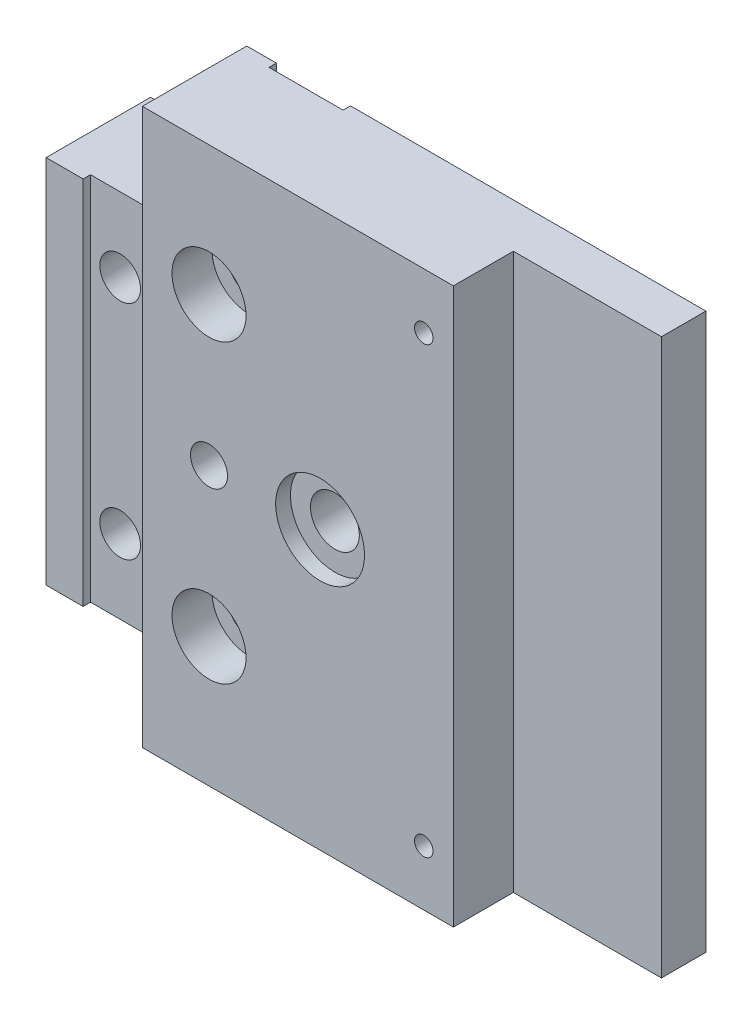
ISO-10303-21;
HEADER;
FILE_DESCRIPTION(('STEP AP214'),'2;1');
FILE_NAME('part.step','',(''),(''),'','','');
FILE_SCHEMA(('AUTOMOTIVE_DESIGN { 1 0 10303 214 1 1 1 1 }'));
ENDSEC;
DATA;
#1=APPLICATION_CONTEXT('core data for automotive mechanical design processes');
#2=APPLICATION_PROTOCOL_DEFINITION('international standard','automotive_design',2000,#1);
#3=PRODUCT_CONTEXT('',#1,'mechanical');
#4=PRODUCT('Part','Part','',(#3));
#5=PRODUCT_RELATED_PRODUCT_CATEGORY('part','',(#4));
#6=PRODUCT_DEFINITION_FORMATION('','',#4);
#7=PRODUCT_DEFINITION_CONTEXT('part definition',#1,'design');
#8=PRODUCT_DEFINITION('design','',#6,#7);
#9=PRODUCT_DEFINITION_SHAPE('','',#8);
#10=(LENGTH_UNIT() NAMED_UNIT(*) SI_UNIT(.MILLI.,.METRE.));
#11=(NAMED_UNIT(*) PLANE_ANGLE_UNIT() SI_UNIT($,.RADIAN.));
#12=(NAMED_UNIT(*) SI_UNIT($,.STERADIAN.) SOLID_ANGLE_UNIT());
#13=UNCERTAINTY_MEASURE_WITH_UNIT(LENGTH_MEASURE(1.E-05),#10,'distance_accuracy_value','');
#14=(GEOMETRIC_REPRESENTATION_CONTEXT(3) GLOBAL_UNCERTAINTY_ASSIGNED_CONTEXT((#13)) GLOBAL_UNIT_ASSIGNED_CONTEXT((#10,
#11,#12)) REPRESENTATION_CONTEXT('',''));
#15=CARTESIAN_POINT('',(0.,0.,0.));
#16=DIRECTION('',(0.,0.,1.));
#17=DIRECTION('',(1.,0.,0.));
#18=AXIS2_PLACEMENT_3D('',#15,#16,#17);
#19=CARTESIAN_POINT('',(0.,0.,0.));
#20=DIRECTION('',(0.,0.,-1.));
#21=DIRECTION('',(-1.,0.,0.));
#22=AXIS2_PLACEMENT_3D('',#19,#20,#21);
#23=PLANE('',#22);
#24=DIRECTION('',(0.,-1.,0.));
#25=VECTOR('',#24,1.);
#26=CARTESIAN_POINT('',(-28.,75.,0.));
#27=LINE('',#26,#25);
#28=CARTESIAN_POINT('',(-28.,75.,0.));
#29=VERTEX_POINT('',#28);
#30=CARTESIAN_POINT('',(-28.,0.,0.));
#31=VERTEX_POINT('',#30);
#32=EDGE_CURVE('E263',#29,#31,#27,.T.);
#33=ORIENTED_EDGE('',*,*,#32,.F.);
#34=DIRECTION('',(-1.,0.,0.));
#35=VECTOR('',#34,1.);
#36=CARTESIAN_POINT('',(0.,75.,0.));
#37=LINE('',#36,#35);
#38=CARTESIAN_POINT('',(20.,75.,0.));
#39=VERTEX_POINT('',#38);
#40=EDGE_CURVE('E210',#39,#29,#37,.T.);
#41=ORIENTED_EDGE('',*,*,#40,.F.);
#42=DIRECTION('',(0.,1.,0.));
#43=VECTOR('',#42,1.);
#44=CARTESIAN_POINT('',(20.,0.,0.));
#45=LINE('',#44,#43);
#46=CARTESIAN_POINT('',(20.,0.,0.));
#47=VERTEX_POINT('',#46);
#48=EDGE_CURVE('E216',#47,#39,#45,.T.);
#49=ORIENTED_EDGE('',*,*,#48,.F.);
#50=DIRECTION('',(1.,0.,0.));
#51=VECTOR('',#50,1.);
#52=CARTESIAN_POINT('',(0.,0.,0.));
#53=LINE('',#52,#51);
#54=EDGE_CURVE('E206',#31,#47,#53,.T.);
#55=ORIENTED_EDGE('',*,*,#54,.F.);
#56=EDGE_LOOP('',(#33,#41,#49,#55));
#57=FACE_BOUND('',#56,.T.);
#58=CARTESIAN_POINT('',(-18.,37.5,0.));
#59=DIRECTION('',(0.,0.,-1.));
#60=DIRECTION('',(-1.,0.,0.));
#61=AXIS2_PLACEMENT_3D('',#58,#59,#60);
#62=CIRCLE('',#61,5.49999999999999);
#63=CARTESIAN_POINT('',(-23.5,37.5,0.));
#64=VERTEX_POINT('',#63);
#65=EDGE_CURVE('E229',#64,#64,#62,.T.);
#66=ORIENTED_EDGE('',*,*,#65,.F.);
#67=EDGE_LOOP('',(#66));
#68=FACE_BOUND('',#67,.T.);
#69=ADVANCED_FACE('F39',(#57,#68),#23,.T.);
#70=CARTESIAN_POINT('',(-33.,37.5,14.1));
#71=DIRECTION('',(0.,0.,1.));
#72=DIRECTION('',(1.,0.,0.));
#73=AXIS2_PLACEMENT_3D('',#70,#71,#72);
#74=CYLINDRICAL_SURFACE('',#73,2.49999999999999);
#75=CARTESIAN_POINT('',(-33.,37.5,14.1));
#76=DIRECTION('',(0.,0.,1.));
#77=DIRECTION('',(1.,0.,0.));
#78=AXIS2_PLACEMENT_3D('',#75,#76,#77);
#79=CIRCLE('',#78,2.49999999999999);
#80=CARTESIAN_POINT('',(-30.5,37.5,14.1));
#81=VERTEX_POINT('',#80);
#82=EDGE_CURVE('E316',#81,#81,#79,.T.);
#83=ORIENTED_EDGE('',*,*,#82,.T.);
#84=EDGE_LOOP('',(#83));
#85=FACE_BOUND('',#84,.T.);
#86=CARTESIAN_POINT('',(-33.,37.5,0.999999999999999));
#87=DIRECTION('',(0.,0.,-1.));
#88=DIRECTION('',(-1.,0.,0.));
#89=AXIS2_PLACEMENT_3D('',#86,#87,#88);
#90=CIRCLE('',#89,2.49999999999999);
#91=CARTESIAN_POINT('',(-35.5,37.5,0.999999999999999));
#92=VERTEX_POINT('',#91);
#93=EDGE_CURVE('E295',#92,#92,#90,.F.);
#94=ORIENTED_EDGE('',*,*,#93,.F.);
#95=EDGE_LOOP('',(#94));
#96=FACE_BOUND('',#95,.T.);
#97=ADVANCED_FACE('F385',(#85,#96),#74,.F.);
#98=CARTESIAN_POINT('',(-33.,17.5,14.1));
#99=DIRECTION('',(0.,0.,1.));
#100=DIRECTION('',(1.,0.,0.));
#101=AXIS2_PLACEMENT_3D('',#98,#99,#100);
#102=CYLINDRICAL_SURFACE('',#101,2.75);
#103=CARTESIAN_POINT('',(-33.,17.5,8.7));
#104=DIRECTION('',(0.,0.,1.));
#105=DIRECTION('',(1.,0.,0.));
#106=AXIS2_PLACEMENT_3D('',#103,#104,#105);
#107=CIRCLE('',#106,2.75);
#108=CARTESIAN_POINT('',(-30.25,17.5,8.7));
#109=VERTEX_POINT('',#108);
#110=EDGE_CURVE('E313',#109,#109,#107,.T.);
#111=ORIENTED_EDGE('',*,*,#110,.T.);
#112=EDGE_LOOP('',(#111));
#113=FACE_BOUND('',#112,.T.);
#114=CARTESIAN_POINT('',(-33.,17.5,0.999999999999999));
#115=DIRECTION('',(0.,0.,-1.));
#116=DIRECTION('',(-1.,0.,0.));
#117=AXIS2_PLACEMENT_3D('',#114,#115,#116);
#118=CIRCLE('',#117,2.75);
#119=CARTESIAN_POINT('',(-35.75,17.5,0.999999999999999));
#120=VERTEX_POINT('',#119);
#121=EDGE_CURVE('E243',#120,#120,#118,.F.);
#122=ORIENTED_EDGE('',*,*,#121,.F.);
#123=EDGE_LOOP('',(#122));
#124=FACE_BOUND('',#123,.T.);
#125=ADVANCED_FACE('F391',(#113,#124),#102,.F.);
#126=CARTESIAN_POINT('',(-33.,57.5,14.1));
#127=DIRECTION('',(0.,0.,1.));
#128=DIRECTION('',(1.,0.,0.));
#129=AXIS2_PLACEMENT_3D('',#126,#127,#128);
#130=CYLINDRICAL_SURFACE('',#129,2.75);
#131=CARTESIAN_POINT('',(-33.,57.5,8.7));
#132=DIRECTION('',(0.,0.,1.));
#133=DIRECTION('',(1.,0.,0.));
#134=AXIS2_PLACEMENT_3D('',#131,#132,#133);
#135=CIRCLE('',#134,2.75);
#136=CARTESIAN_POINT('',(-30.25,57.5,8.7));
#137=VERTEX_POINT('',#136);
#138=EDGE_CURVE('E304',#137,#137,#135,.T.);
#139=ORIENTED_EDGE('',*,*,#138,.T.);
#140=EDGE_LOOP('',(#139));
#141=FACE_BOUND('',#140,.T.);
#142=CARTESIAN_POINT('',(-33.,57.5,0.999999999999999));
#143=DIRECTION('',(0.,0.,-1.));
#144=DIRECTION('',(-1.,0.,0.));
#145=AXIS2_PLACEMENT_3D('',#142,#143,#144);
#146=CIRCLE('',#145,2.75);
#147=CARTESIAN_POINT('',(-35.75,57.5,0.999999999999999));
#148=VERTEX_POINT('',#147);
#149=EDGE_CURVE('E241',#148,#148,#146,.F.);
#150=ORIENTED_EDGE('',*,*,#149,.F.);
#151=EDGE_LOOP('',(#150));
#152=FACE_BOUND('',#151,.T.);
#153=ADVANCED_FACE('F438',(#141,#152),#130,.F.);
#154=CARTESIAN_POINT('',(0.,0.,14.1));
#155=DIRECTION('',(0.,0.,1.));
#156=DIRECTION('',(1.,0.,0.));
#157=AXIS2_PLACEMENT_3D('',#154,#155,#156);
#158=PLANE('',#157);
#159=CARTESIAN_POINT('',(-33.,57.5,14.1));
#160=DIRECTION('',(0.,0.,1.));
#161=DIRECTION('',(1.,0.,0.));
#162=AXIS2_PLACEMENT_3D('',#159,#160,#161);
#163=CIRCLE('',#162,4.99999999999999);
#164=CARTESIAN_POINT('',(-28.,57.5,14.1));
#165=VERTEX_POINT('',#164);
#166=EDGE_CURVE('E298',#165,#165,#163,.T.);
#167=ORIENTED_EDGE('',*,*,#166,.F.);
#168=EDGE_LOOP('',(#167));
#169=FACE_BOUND('',#168,.T.);
#170=CARTESIAN_POINT('',(-33.,17.5,14.1));
#171=DIRECTION('',(0.,0.,1.));
#172=DIRECTION('',(1.,0.,0.));
#173=AXIS2_PLACEMENT_3D('',#170,#171,#172);
#174=CIRCLE('',#173,4.99999999999999);
#175=CARTESIAN_POINT('',(-28.,17.5,14.1));
#176=VERTEX_POINT('',#175);
#177=EDGE_CURVE('E307',#176,#176,#174,.T.);
#178=ORIENTED_EDGE('',*,*,#177,.F.);
#179=EDGE_LOOP('',(#178));
#180=FACE_BOUND('',#179,.T.);
#181=ORIENTED_EDGE('',*,*,#82,.F.);
#182=EDGE_LOOP('',(#181));
#183=FACE_BOUND('',#182,.T.);
#184=DIRECTION('',(0.,1.,0.));
#185=VECTOR('',#184,1.);
#186=CARTESIAN_POINT('',(-42.,0.,14.1));
#187=LINE('',#186,#185);
#188=CARTESIAN_POINT('',(-42.,0.,14.1));
#189=VERTEX_POINT('',#188);
#190=CARTESIAN_POINT('',(-42.,75.,14.1));
#191=VERTEX_POINT('',#190);
#192=EDGE_CURVE('E234',#189,#191,#187,.T.);
#193=ORIENTED_EDGE('',*,*,#192,.F.);
#194=DIRECTION('',(1.,0.,0.));
#195=VECTOR('',#194,1.);
#196=CARTESIAN_POINT('',(-20.,0.,14.1));
#197=LINE('',#196,#195);
#198=CARTESIAN_POINT('',(0.,0.,14.1));
#199=VERTEX_POINT('',#198);
#200=EDGE_CURVE('E188',#189,#199,#197,.T.);
#201=ORIENTED_EDGE('',*,*,#200,.T.);
#202=DIRECTION('',(0.,1.,0.));
#203=VECTOR('',#202,1.);
#204=CARTESIAN_POINT('',(0.,75.,14.1));
#205=LINE('',#204,#203);
#206=CARTESIAN_POINT('',(0.,75.,14.1));
#207=VERTEX_POINT('',#206);
#208=EDGE_CURVE('E195',#199,#207,#205,.T.);
#209=ORIENTED_EDGE('',*,*,#208,.T.);
#210=DIRECTION('',(-1.,0.,0.));
#211=VECTOR('',#210,1.);
#212=CARTESIAN_POINT('',(-20.,75.,14.1));
#213=LINE('',#212,#211);
#214=EDGE_CURVE('E197',#207,#191,#213,.T.);
#215=ORIENTED_EDGE('',*,*,#214,.T.);
#216=EDGE_LOOP('',(#193,#201,#209,#215));
#217=FACE_BOUND('',#216,.T.);
#218=CARTESIAN_POINT('',(-3.99999999999999,7.50000000000002,14.1));
#219=DIRECTION('',(0.,0.,1.));
#220=DIRECTION('',(1.,0.,0.));
#221=AXIS2_PLACEMENT_3D('',#218,#219,#220);
#222=CIRCLE('',#221,1.25);
#223=CARTESIAN_POINT('',(-2.74999999999999,7.50000000000002,14.1));
#224=VERTEX_POINT('',#223);
#225=EDGE_CURVE('E342',#224,#224,#222,.T.);
#226=ORIENTED_EDGE('',*,*,#225,.F.);
#227=EDGE_LOOP('',(#226));
#228=FACE_BOUND('',#227,.T.);
#229=CARTESIAN_POINT('',(-3.99999999999999,67.5,14.1));
#230=DIRECTION('',(0.,0.,1.));
#231=DIRECTION('',(1.,0.,0.));
#232=AXIS2_PLACEMENT_3D('',#229,#230,#231);
#233=CIRCLE('',#232,1.25);
#234=CARTESIAN_POINT('',(-2.74999999999999,67.5,14.1));
#235=VERTEX_POINT('',#234);
#236=EDGE_CURVE('E350',#235,#235,#233,.T.);
#237=ORIENTED_EDGE('',*,*,#236,.F.);
#238=EDGE_LOOP('',(#237));
#239=FACE_BOUND('',#238,.T.);
#240=CARTESIAN_POINT('',(-18.,37.5,14.1));
#241=DIRECTION('',(0.,0.,1.));
#242=DIRECTION('',(1.,0.,0.));
#243=AXIS2_PLACEMENT_3D('',#240,#241,#242);
#244=CIRCLE('',#243,6.);
#245=CARTESIAN_POINT('',(-12.,37.5,14.1));
#246=VERTEX_POINT('',#245);
#247=EDGE_CURVE('E356',#246,#246,#244,.T.);
#248=ORIENTED_EDGE('',*,*,#247,.F.);
#249=EDGE_LOOP('',(#248));
#250=FACE_BOUND('',#249,.T.);
#251=ADVANCED_FACE('F432',(#169,#180,#183,#217,#228,#239,#250),#158,.T.);
#252=CARTESIAN_POINT('',(-18.,37.5,0.));
#253=DIRECTION('',(0.,0.,-1.));
#254=DIRECTION('',(-1.,0.,0.));
#255=AXIS2_PLACEMENT_3D('',#252,#253,#254);
#256=CYLINDRICAL_SURFACE('',#255,3.3);
#257=CARTESIAN_POINT('',(-18.,37.5,6.4));
#258=DIRECTION('',(0.,0.,-1.));
#259=DIRECTION('',(-1.,0.,0.));
#260=AXIS2_PLACEMENT_3D('',#257,#258,#259);
#261=CIRCLE('',#260,3.3);
#262=CARTESIAN_POINT('',(-21.3,37.5,6.4));
#263=VERTEX_POINT('',#262);
#264=EDGE_CURVE('E190',#263,#263,#261,.T.);
#265=ORIENTED_EDGE('',*,*,#264,.T.);
#266=EDGE_LOOP('',(#265));
#267=FACE_BOUND('',#266,.T.);
#268=CARTESIAN_POINT('',(-18.,37.5,12.1));
#269=DIRECTION('',(0.,0.,1.));
#270=DIRECTION('',(1.,0.,0.));
#271=AXIS2_PLACEMENT_3D('',#268,#269,#270);
#272=CIRCLE('',#271,3.3);
#273=CARTESIAN_POINT('',(-14.7,37.5,12.1));
#274=VERTEX_POINT('',#273);
#275=EDGE_CURVE('E226',#274,#274,#272,.F.);
#276=ORIENTED_EDGE('',*,*,#275,.F.);
#277=EDGE_LOOP('',(#276));
#278=FACE_BOUND('',#277,.T.);
#279=ADVANCED_FACE('F368',(#267,#278),#256,.F.);
#280=CARTESIAN_POINT('',(0.,0.,6.));
#281=DIRECTION('',(0.,0.,-1.));
#282=DIRECTION('',(-1.,0.,0.));
#283=AXIS2_PLACEMENT_3D('',#280,#281,#282);
#284=PLANE('',#283);
#285=DIRECTION('',(0.,1.,0.));
#286=VECTOR('',#285,1.);
#287=CARTESIAN_POINT('',(0.,75.,6.));
#288=LINE('',#287,#286);
#289=CARTESIAN_POINT('',(0.,0.,6.));
#290=VERTEX_POINT('',#289);
#291=CARTESIAN_POINT('',(0.,75.,6.));
#292=VERTEX_POINT('',#291);
#293=EDGE_CURVE('E185',#290,#292,#288,.T.);
#294=ORIENTED_EDGE('',*,*,#293,.F.);
#295=DIRECTION('',(1.,0.,0.));
#296=VECTOR('',#295,1.);
#297=CARTESIAN_POINT('',(0.,0.,6.));
#298=LINE('',#297,#296);
#299=CARTESIAN_POINT('',(20.,0.,6.));
#300=VERTEX_POINT('',#299);
#301=EDGE_CURVE('E207',#290,#300,#298,.T.);
#302=ORIENTED_EDGE('',*,*,#301,.T.);
#303=DIRECTION('',(0.,1.,0.));
#304=VECTOR('',#303,1.);
#305=CARTESIAN_POINT('',(20.,0.,6.));
#306=LINE('',#305,#304);
#307=CARTESIAN_POINT('',(20.,75.,6.));
#308=VERTEX_POINT('',#307);
#309=EDGE_CURVE('E209',#300,#308,#306,.T.);
#310=ORIENTED_EDGE('',*,*,#309,.T.);
#311=DIRECTION('',(-1.,0.,0.));
#312=VECTOR('',#311,1.);
#313=CARTESIAN_POINT('',(0.,75.,6.));
#314=LINE('',#313,#312);
#315=EDGE_CURVE('E212',#308,#292,#314,.T.);
#316=ORIENTED_EDGE('',*,*,#315,.T.);
#317=EDGE_LOOP('',(#294,#302,#310,#316));
#318=FACE_BOUND('',#317,.T.);
#319=ADVANCED_FACE('F444',(#318),#284,.F.);
#320=CARTESIAN_POINT('',(0.,0.,6.));
#321=DIRECTION('',(0.,1.,0.));
#322=DIRECTION('',(0.,0.,1.));
#323=AXIS2_PLACEMENT_3D('',#320,#321,#322);
#324=PLANE('',#323);
#325=DIRECTION('',(0.,0.,1.));
#326=VECTOR('',#325,1.);
#327=CARTESIAN_POINT('',(-42.,0.,13.1));
#328=LINE('',#327,#326);
#329=CARTESIAN_POINT('',(-42.,0.,0.));
#330=VERTEX_POINT('',#329);
#331=EDGE_CURVE('E340',#330,#189,#328,.T.);
#332=ORIENTED_EDGE('',*,*,#331,.F.);
#333=CARTESIAN_POINT('',(-38.,0.,0.));
#334=VERTEX_POINT('',#333);
#335=EDGE_CURVE('E61',#330,#334,#53,.T.);
#336=ORIENTED_EDGE('',*,*,#335,.T.);
#337=DIRECTION('',(0.,0.,-1.));
#338=VECTOR('',#337,1.);
#339=CARTESIAN_POINT('',(-38.,0.,1.));
#340=LINE('',#339,#338);
#341=CARTESIAN_POINT('',(-38.,0.,1.));
#342=VERTEX_POINT('',#341);
#343=EDGE_CURVE('E289',#342,#334,#340,.T.);
#344=ORIENTED_EDGE('',*,*,#343,.F.);
#345=DIRECTION('',(-1.,0.,0.));
#346=VECTOR('',#345,1.);
#347=CARTESIAN_POINT('',(-28.,0.,1.));
#348=LINE('',#347,#346);
#349=CARTESIAN_POINT('',(-28.,0.,1.));
#350=VERTEX_POINT('',#349);
#351=EDGE_CURVE('E274',#350,#342,#348,.T.);
#352=ORIENTED_EDGE('',*,*,#351,.F.);
#353=DIRECTION('',(0.,0.,-1.));
#354=VECTOR('',#353,1.);
#355=CARTESIAN_POINT('',(-28.,0.,1.));
#356=LINE('',#355,#354);
#357=EDGE_CURVE('E282',#350,#31,#356,.T.);
#358=ORIENTED_EDGE('',*,*,#357,.T.);
#359=ORIENTED_EDGE('',*,*,#54,.T.);
#360=DIRECTION('',(0.,0.,-1.));
#361=VECTOR('',#360,1.);
#362=CARTESIAN_POINT('',(20.,0.,6.));
#363=LINE('',#362,#361);
#364=EDGE_CURVE('E223',#300,#47,#363,.T.);
#365=ORIENTED_EDGE('',*,*,#364,.F.);
#366=ORIENTED_EDGE('',*,*,#301,.F.);
#367=DIRECTION('',(0.,0.,-1.));
#368=VECTOR('',#367,1.);
#369=CARTESIAN_POINT('',(0.,0.,14.1));
#370=LINE('',#369,#368);
#371=EDGE_CURVE('E203',#199,#290,#370,.T.);
#372=ORIENTED_EDGE('',*,*,#371,.F.);
#373=ORIENTED_EDGE('',*,*,#200,.F.);
#374=EDGE_LOOP('',(#332,#336,#344,#352,#358,#359,#365,#366,#372,#373));
#375=FACE_BOUND('',#374,.T.);
#376=ADVANCED_FACE('F41',(#375),#324,.F.);
#377=CARTESIAN_POINT('',(20.,0.,6.));
#378=DIRECTION('',(-1.,0.,0.));
#379=DIRECTION('',(0.,-1.,0.));
#380=AXIS2_PLACEMENT_3D('',#377,#378,#379);
#381=PLANE('',#380);
#382=ORIENTED_EDGE('',*,*,#48,.T.);
#383=DIRECTION('',(0.,0.,-1.));
#384=VECTOR('',#383,1.);
#385=CARTESIAN_POINT('',(20.,75.,6.));
#386=LINE('',#385,#384);
#387=EDGE_CURVE('E214',#308,#39,#386,.T.);
#388=ORIENTED_EDGE('',*,*,#387,.F.);
#389=ORIENTED_EDGE('',*,*,#309,.F.);
#390=ORIENTED_EDGE('',*,*,#364,.T.);
#391=EDGE_LOOP('',(#382,#388,#389,#390));
#392=FACE_BOUND('',#391,.T.);
#393=ADVANCED_FACE('F408',(#392),#381,.F.);
#394=CARTESIAN_POINT('',(0.,75.,6.));
#395=DIRECTION('',(0.,-1.,0.));
#396=DIRECTION('',(0.,0.,-1.));
#397=AXIS2_PLACEMENT_3D('',#394,#395,#396);
#398=PLANE('',#397);
#399=CARTESIAN_POINT('',(-38.,75.,0.));
#400=VERTEX_POINT('',#399);
#401=CARTESIAN_POINT('',(-42.,75.,0.));
#402=VERTEX_POINT('',#401);
#403=EDGE_CURVE('E218',#400,#402,#37,.T.);
#404=ORIENTED_EDGE('',*,*,#403,.T.);
#405=DIRECTION('',(0.,0.,1.));
#406=VECTOR('',#405,1.);
#407=CARTESIAN_POINT('',(-42.,75.,13.1));
#408=LINE('',#407,#406);
#409=EDGE_CURVE('E337',#402,#191,#408,.T.);
#410=ORIENTED_EDGE('',*,*,#409,.T.);
#411=ORIENTED_EDGE('',*,*,#214,.F.);
#412=DIRECTION('',(0.,0.,-1.));
#413=VECTOR('',#412,1.);
#414=CARTESIAN_POINT('',(0.,75.,14.1));
#415=LINE('',#414,#413);
#416=EDGE_CURVE('E199',#207,#292,#415,.T.);
#417=ORIENTED_EDGE('',*,*,#416,.T.);
#418=ORIENTED_EDGE('',*,*,#315,.F.);
#419=ORIENTED_EDGE('',*,*,#387,.T.);
#420=ORIENTED_EDGE('',*,*,#40,.T.);
#421=DIRECTION('',(0.,0.,-1.));
#422=VECTOR('',#421,1.);
#423=CARTESIAN_POINT('',(-28.,75.,1.));
#424=LINE('',#423,#422);
#425=CARTESIAN_POINT('',(-28.,75.,1.));
#426=VERTEX_POINT('',#425);
#427=EDGE_CURVE('E244',#426,#29,#424,.T.);
#428=ORIENTED_EDGE('',*,*,#427,.F.);
#429=DIRECTION('',(1.,0.,0.));
#430=VECTOR('',#429,1.);
#431=CARTESIAN_POINT('',(-28.,75.,1.));
#432=LINE('',#431,#430);
#433=CARTESIAN_POINT('',(-38.,75.,1.));
#434=VERTEX_POINT('',#433);
#435=EDGE_CURVE('E280',#434,#426,#432,.T.);
#436=ORIENTED_EDGE('',*,*,#435,.F.);
#437=DIRECTION('',(0.,0.,-1.));
#438=VECTOR('',#437,1.);
#439=CARTESIAN_POINT('',(-38.,75.,1.));
#440=LINE('',#439,#438);
#441=EDGE_CURVE('E286',#434,#400,#440,.T.);
#442=ORIENTED_EDGE('',*,*,#441,.T.);
#443=EDGE_LOOP('',(#404,#410,#411,#417,#418,#419,#420,#428,#436,#442));
#444=FACE_BOUND('',#443,.T.);
#445=ADVANCED_FACE('F399',(#444),#398,.F.);
#446=DIRECTION('',(0.,1.,0.));
#447=VECTOR('',#446,1.);
#448=CARTESIAN_POINT('',(-42.,75.,0.));
#449=LINE('',#448,#447);
#450=CARTESIAN_POINT('',(-42.,62.5,0.));
#451=VERTEX_POINT('',#450);
#452=EDGE_CURVE('E167',#451,#402,#449,.T.);
#453=ORIENTED_EDGE('',*,*,#452,.T.);
#454=ORIENTED_EDGE('',*,*,#403,.F.);
#455=DIRECTION('',(0.,1.,0.));
#456=VECTOR('',#455,1.);
#457=CARTESIAN_POINT('',(-38.,75.,0.));
#458=LINE('',#457,#456);
#459=EDGE_CURVE('E266',#334,#400,#458,.T.);
#460=ORIENTED_EDGE('',*,*,#459,.F.);
#461=ORIENTED_EDGE('',*,*,#335,.F.);
#462=DIRECTION('',(0.,1.,0.));
#463=VECTOR('',#462,1.);
#464=CARTESIAN_POINT('',(-42.,0.,0.));
#465=LINE('',#464,#463);
#466=CARTESIAN_POINT('',(-42.,12.5,0.));
#467=VERTEX_POINT('',#466);
#468=EDGE_CURVE('E427',#330,#467,#465,.T.);
#469=ORIENTED_EDGE('',*,*,#468,.T.);
#470=DIRECTION('',(-1.,0.,0.));
#471=VECTOR('',#470,1.);
#472=CARTESIAN_POINT('',(-55.,12.5,0.));
#473=LINE('',#472,#471);
#474=CARTESIAN_POINT('',(-55.,12.5,0.));
#475=VERTEX_POINT('',#474);
#476=EDGE_CURVE('E184',#467,#475,#473,.T.);
#477=ORIENTED_EDGE('',*,*,#476,.T.);
#478=DIRECTION('',(0.,-1.,0.));
#479=VECTOR('',#478,1.);
#480=CARTESIAN_POINT('',(-55.,0.,0.));
#481=LINE('',#480,#479);
#482=CARTESIAN_POINT('',(-55.,62.5,0.));
#483=VERTEX_POINT('',#482);
#484=EDGE_CURVE('E174',#483,#475,#481,.T.);
#485=ORIENTED_EDGE('',*,*,#484,.F.);
#486=DIRECTION('',(1.,0.,0.));
#487=VECTOR('',#486,1.);
#488=CARTESIAN_POINT('',(-55.,62.5,0.));
#489=LINE('',#488,#487);
#490=EDGE_CURVE('E156',#483,#451,#489,.T.);
#491=ORIENTED_EDGE('',*,*,#490,.T.);
#492=EDGE_LOOP('',(#453,#454,#460,#461,#469,#477,#485,#491));
#493=FACE_BOUND('',#492,.T.);
#494=CARTESIAN_POINT('',(-46.,52.5,0.));
#495=DIRECTION('',(0.,0.,-1.));
#496=DIRECTION('',(-1.,0.,0.));
#497=AXIS2_PLACEMENT_3D('',#494,#495,#496);
#498=CIRCLE('',#497,5.);
#499=CARTESIAN_POINT('',(-51.,52.5,0.));
#500=VERTEX_POINT('',#499);
#501=EDGE_CURVE('E319',#500,#500,#498,.T.);
#502=ORIENTED_EDGE('',*,*,#501,.F.);
#503=EDGE_LOOP('',(#502));
#504=FACE_BOUND('',#503,.T.);
#505=CARTESIAN_POINT('',(-46.,22.5,0.));
#506=DIRECTION('',(0.,0.,-1.));
#507=DIRECTION('',(-1.,0.,0.));
#508=AXIS2_PLACEMENT_3D('',#505,#506,#507);
#509=CIRCLE('',#508,5.);
#510=CARTESIAN_POINT('',(-51.,22.5,0.));
#511=VERTEX_POINT('',#510);
#512=EDGE_CURVE('E239',#511,#511,#509,.T.);
#513=ORIENTED_EDGE('',*,*,#512,.F.);
#514=EDGE_LOOP('',(#513));
#515=FACE_BOUND('',#514,.T.);
#516=ADVANCED_FACE('F180',(#493,#504,#515),#23,.T.);
#517=CARTESIAN_POINT('',(0.,75.,14.1));
#518=DIRECTION('',(-1.,0.,0.));
#519=DIRECTION('',(0.,-1.,0.));
#520=AXIS2_PLACEMENT_3D('',#517,#518,#519);
#521=PLANE('',#520);
#522=ORIENTED_EDGE('',*,*,#293,.T.);
#523=ORIENTED_EDGE('',*,*,#416,.F.);
#524=ORIENTED_EDGE('',*,*,#208,.F.);
#525=ORIENTED_EDGE('',*,*,#371,.T.);
#526=EDGE_LOOP('',(#522,#523,#524,#525));
#527=FACE_BOUND('',#526,.T.);
#528=ADVANCED_FACE('F398',(#527),#521,.F.);
#529=DIRECTION('',(1.,0.,0.));
#530=VECTOR('',#529,1.);
#531=CARTESIAN_POINT('',(-55.,62.5,14.1));
#532=LINE('',#531,#530);
#533=CARTESIAN_POINT('',(-55.,62.5,14.1));
#534=VERTEX_POINT('',#533);
#535=CARTESIAN_POINT('',(-50.,62.5,14.1));
#536=VERTEX_POINT('',#535);
#537=EDGE_CURVE('E168',#534,#536,#532,.T.);
#538=ORIENTED_EDGE('',*,*,#537,.F.);
#539=DIRECTION('',(0.,1.,0.));
#540=VECTOR('',#539,1.);
#541=CARTESIAN_POINT('',(-55.,0.,14.1));
#542=LINE('',#541,#540);
#543=CARTESIAN_POINT('',(-55.,12.5,14.1));
#544=VERTEX_POINT('',#543);
#545=EDGE_CURVE('E177',#544,#534,#542,.T.);
#546=ORIENTED_EDGE('',*,*,#545,.F.);
#547=DIRECTION('',(-1.,0.,0.));
#548=VECTOR('',#547,1.);
#549=CARTESIAN_POINT('',(-55.,12.5,14.1));
#550=LINE('',#549,#548);
#551=CARTESIAN_POINT('',(-50.,12.5,14.1));
#552=VERTEX_POINT('',#551);
#553=EDGE_CURVE('E426',#552,#544,#550,.T.);
#554=ORIENTED_EDGE('',*,*,#553,.F.);
#555=DIRECTION('',(0.,-1.,0.));
#556=VECTOR('',#555,1.);
#557=CARTESIAN_POINT('',(-50.,0.,14.1));
#558=LINE('',#557,#556);
#559=EDGE_CURVE('E262',#536,#552,#558,.T.);
#560=ORIENTED_EDGE('',*,*,#559,.F.);
#561=EDGE_LOOP('',(#538,#546,#554,#560));
#562=FACE_BOUND('',#561,.T.);
#563=ADVANCED_FACE('F405',(#562),#158,.T.);
#564=CARTESIAN_POINT('',(-55.,0.,0.));
#565=DIRECTION('',(-1.,0.,0.));
#566=DIRECTION('',(0.,-1.,0.));
#567=AXIS2_PLACEMENT_3D('',#564,#565,#566);
#568=PLANE('',#567);
#569=DIRECTION('',(0.,0.,1.));
#570=VECTOR('',#569,1.);
#571=CARTESIAN_POINT('',(-55.,62.5,0.));
#572=LINE('',#571,#570);
#573=EDGE_CURVE('E159',#483,#534,#572,.T.);
#574=ORIENTED_EDGE('',*,*,#573,.F.);
#575=ORIENTED_EDGE('',*,*,#484,.T.);
#576=DIRECTION('',(0.,0.,1.));
#577=VECTOR('',#576,1.);
#578=CARTESIAN_POINT('',(-55.,12.5,0.));
#579=LINE('',#578,#577);
#580=EDGE_CURVE('E264',#475,#544,#579,.T.);
#581=ORIENTED_EDGE('',*,*,#580,.T.);
#582=ORIENTED_EDGE('',*,*,#545,.T.);
#583=EDGE_LOOP('',(#574,#575,#581,#582));
#584=FACE_BOUND('',#583,.T.);
#585=ADVANCED_FACE('F172',(#584),#568,.T.);
#586=CARTESIAN_POINT('',(-14.7,37.5,6.4));
#587=DIRECTION('',(0.,0.,1.));
#588=DIRECTION('',(1.,0.,0.));
#589=AXIS2_PLACEMENT_3D('',#586,#587,#588);
#590=PLANE('',#589);
#591=ORIENTED_EDGE('',*,*,#264,.F.);
#592=EDGE_LOOP('',(#591));
#593=FACE_BOUND('',#592,.T.);
#594=CARTESIAN_POINT('',(-18.,37.5,6.4));
#595=DIRECTION('',(0.,0.,-1.));
#596=DIRECTION('',(-1.,0.,0.));
#597=AXIS2_PLACEMENT_3D('',#594,#595,#596);
#598=CIRCLE('',#597,5.5);
#599=CARTESIAN_POINT('',(-23.5,37.5,6.4));
#600=VERTEX_POINT('',#599);
#601=EDGE_CURVE('E363',#600,#600,#598,.T.);
#602=ORIENTED_EDGE('',*,*,#601,.T.);
#603=EDGE_LOOP('',(#602));
#604=FACE_BOUND('',#603,.T.);
#605=ADVANCED_FACE('F371',(#593,#604),#590,.F.);
#606=CARTESIAN_POINT('',(-18.,37.5,0.));
#607=DIRECTION('',(0.,0.,-1.));
#608=DIRECTION('',(-1.,0.,0.));
#609=AXIS2_PLACEMENT_3D('',#606,#607,#608);
#610=CYLINDRICAL_SURFACE('',#609,5.5);
#611=ORIENTED_EDGE('',*,*,#601,.F.);
#612=EDGE_LOOP('',(#611));
#613=FACE_BOUND('',#612,.T.);
#614=ORIENTED_EDGE('',*,*,#65,.T.);
#615=EDGE_LOOP('',(#614));
#616=FACE_BOUND('',#615,.T.);
#617=ADVANCED_FACE('F374',(#613,#616),#610,.F.);
#618=CARTESIAN_POINT('',(-18.,37.5,12.1));
#619=DIRECTION('',(0.,0.,1.));
#620=DIRECTION('',(1.,0.,0.));
#621=AXIS2_PLACEMENT_3D('',#618,#619,#620);
#622=PLANE('',#621);
#623=CARTESIAN_POINT('',(-18.,37.5,12.1));
#624=DIRECTION('',(0.,0.,1.));
#625=DIRECTION('',(1.,0.,0.));
#626=AXIS2_PLACEMENT_3D('',#623,#624,#625);
#627=CIRCLE('',#626,6.);
#628=CARTESIAN_POINT('',(-12.,37.5,12.1));
#629=VERTEX_POINT('',#628);
#630=EDGE_CURVE('E230',#629,#629,#627,.T.);
#631=ORIENTED_EDGE('',*,*,#630,.T.);
#632=EDGE_LOOP('',(#631));
#633=FACE_BOUND('',#632,.T.);
#634=ORIENTED_EDGE('',*,*,#275,.T.);
#635=EDGE_LOOP('',(#634));
#636=FACE_BOUND('',#635,.T.);
#637=ADVANCED_FACE('F380',(#633,#636),#622,.T.);
#638=CARTESIAN_POINT('',(-18.,37.5,12.1));
#639=DIRECTION('',(0.,0.,1.));
#640=DIRECTION('',(1.,0.,0.));
#641=AXIS2_PLACEMENT_3D('',#638,#639,#640);
#642=CYLINDRICAL_SURFACE('',#641,6.);
#643=ORIENTED_EDGE('',*,*,#630,.F.);
#644=EDGE_LOOP('',(#643));
#645=FACE_BOUND('',#644,.T.);
#646=ORIENTED_EDGE('',*,*,#247,.T.);
#647=EDGE_LOOP('',(#646));
#648=FACE_BOUND('',#647,.T.);
#649=ADVANCED_FACE('F464',(#645,#648),#642,.F.);
#650=CARTESIAN_POINT('',(-3.99999999999999,67.5,4.));
#651=DIRECTION('',(0.,0.,1.));
#652=DIRECTION('',(1.,0.,0.));
#653=AXIS2_PLACEMENT_3D('',#650,#651,#652);
#654=CONICAL_SURFACE('',#653,1.25,1.02974425867665);
#655=CARTESIAN_POINT('',(-3.99999999999999,67.5,3.24892422621555));
#656=VERTEX_POINT('',#655);
#657=VERTEX_LOOP('',#656);
#658=FACE_BOUND('',#657,.T.);
#659=CARTESIAN_POINT('',(-3.99999999999999,67.5,4.));
#660=DIRECTION('',(0.,0.,1.));
#661=DIRECTION('',(1.,0.,0.));
#662=AXIS2_PLACEMENT_3D('',#659,#660,#661);
#663=CIRCLE('',#662,1.25);
#664=CARTESIAN_POINT('',(-2.74999999999999,67.5,4.));
#665=VERTEX_POINT('',#664);
#666=EDGE_CURVE('E353',#665,#665,#663,.T.);
#667=ORIENTED_EDGE('',*,*,#666,.T.);
#668=EDGE_LOOP('',(#667));
#669=FACE_BOUND('',#668,.T.);
#670=ADVANCED_FACE('F466',(#658,#669),#654,.F.);
#671=CARTESIAN_POINT('',(-3.99999999999999,67.5,14.1));
#672=DIRECTION('',(0.,0.,1.));
#673=DIRECTION('',(1.,0.,0.));
#674=AXIS2_PLACEMENT_3D('',#671,#672,#673);
#675=CYLINDRICAL_SURFACE('',#674,1.25);
#676=ORIENTED_EDGE('',*,*,#666,.F.);
#677=EDGE_LOOP('',(#676));
#678=FACE_BOUND('',#677,.T.);
#679=ORIENTED_EDGE('',*,*,#236,.T.);
#680=EDGE_LOOP('',(#679));
#681=FACE_BOUND('',#680,.T.);
#682=ADVANCED_FACE('F473',(#678,#681),#675,.F.);
#683=CARTESIAN_POINT('',(-3.99999999999999,7.50000000000002,4.));
#684=DIRECTION('',(0.,0.,1.));
#685=DIRECTION('',(1.,0.,0.));
#686=AXIS2_PLACEMENT_3D('',#683,#684,#685);
#687=CONICAL_SURFACE('',#686,1.25,1.02974425867665);
#688=CARTESIAN_POINT('',(-3.99999999999999,7.50000000000002,3.24892422621555));
#689=VERTEX_POINT('',#688);
#690=VERTEX_LOOP('',#689);
#691=FACE_BOUND('',#690,.T.);
#692=CARTESIAN_POINT('',(-3.99999999999999,7.50000000000002,4.));
#693=DIRECTION('',(0.,0.,1.));
#694=DIRECTION('',(1.,0.,0.));
#695=AXIS2_PLACEMENT_3D('',#692,#693,#694);
#696=CIRCLE('',#695,1.25);
#697=CARTESIAN_POINT('',(-2.74999999999999,7.50000000000002,4.));
#698=VERTEX_POINT('',#697);
#699=EDGE_CURVE('E347',#698,#698,#696,.T.);
#700=ORIENTED_EDGE('',*,*,#699,.T.);
#701=EDGE_LOOP('',(#700));
#702=FACE_BOUND('',#701,.T.);
#703=ADVANCED_FACE('F482',(#691,#702),#687,.F.);
#704=CARTESIAN_POINT('',(-3.99999999999999,7.50000000000002,14.1));
#705=DIRECTION('',(0.,0.,1.));
#706=DIRECTION('',(1.,0.,0.));
#707=AXIS2_PLACEMENT_3D('',#704,#705,#706);
#708=CYLINDRICAL_SURFACE('',#707,1.25);
#709=ORIENTED_EDGE('',*,*,#699,.F.);
#710=EDGE_LOOP('',(#709));
#711=FACE_BOUND('',#710,.T.);
#712=ORIENTED_EDGE('',*,*,#225,.T.);
#713=EDGE_LOOP('',(#712));
#714=FACE_BOUND('',#713,.T.);
#715=ADVANCED_FACE('F486',(#711,#714),#708,.F.);
#716=CARTESIAN_POINT('',(-42.,0.,13.1));
#717=DIRECTION('',(1.,0.,0.));
#718=DIRECTION('',(0.,0.,-1.));
#719=AXIS2_PLACEMENT_3D('',#716,#717,#718);
#720=PLANE('',#719);
#721=ORIENTED_EDGE('',*,*,#192,.T.);
#722=ORIENTED_EDGE('',*,*,#409,.F.);
#723=ORIENTED_EDGE('',*,*,#452,.F.);
#724=DIRECTION('',(0.,0.,1.));
#725=VECTOR('',#724,1.);
#726=CARTESIAN_POINT('',(-42.,62.5,0.));
#727=LINE('',#726,#725);
#728=CARTESIAN_POINT('',(-42.,62.5,13.1));
#729=VERTEX_POINT('',#728);
#730=EDGE_CURVE('E162',#451,#729,#727,.T.);
#731=ORIENTED_EDGE('',*,*,#730,.T.);
#732=DIRECTION('',(0.,1.,0.));
#733=VECTOR('',#732,1.);
#734=CARTESIAN_POINT('',(-42.,0.,13.1));
#735=LINE('',#734,#733);
#736=CARTESIAN_POINT('',(-42.,12.5,13.1));
#737=VERTEX_POINT('',#736);
#738=EDGE_CURVE('E334',#737,#729,#735,.T.);
#739=ORIENTED_EDGE('',*,*,#738,.F.);
#740=DIRECTION('',(0.,0.,1.));
#741=VECTOR('',#740,1.);
#742=CARTESIAN_POINT('',(-42.,12.5,0.));
#743=LINE('',#742,#741);
#744=EDGE_CURVE('E253',#467,#737,#743,.T.);
#745=ORIENTED_EDGE('',*,*,#744,.F.);
#746=ORIENTED_EDGE('',*,*,#468,.F.);
#747=ORIENTED_EDGE('',*,*,#331,.T.);
#748=EDGE_LOOP('',(#721,#722,#723,#731,#739,#745,#746,#747));
#749=FACE_BOUND('',#748,.T.);
#750=ADVANCED_FACE('F490',(#749),#720,.F.);
#751=CARTESIAN_POINT('',(-50.,0.,13.1));
#752=DIRECTION('',(-1.,0.,0.));
#753=DIRECTION('',(0.,0.,1.));
#754=AXIS2_PLACEMENT_3D('',#751,#752,#753);
#755=PLANE('',#754);
#756=DIRECTION('',(0.,-1.,0.));
#757=VECTOR('',#756,1.);
#758=CARTESIAN_POINT('',(-50.,0.,13.1));
#759=LINE('',#758,#757);
#760=CARTESIAN_POINT('',(-50.,62.5,13.1));
#761=VERTEX_POINT('',#760);
#762=CARTESIAN_POINT('',(-50.,12.5,13.1));
#763=VERTEX_POINT('',#762);
#764=EDGE_CURVE('E260',#761,#763,#759,.T.);
#765=ORIENTED_EDGE('',*,*,#764,.F.);
#766=DIRECTION('',(0.,0.,1.));
#767=VECTOR('',#766,1.);
#768=CARTESIAN_POINT('',(-50.,62.5,13.1));
#769=LINE('',#768,#767);
#770=EDGE_CURVE('E53',#761,#536,#769,.T.);
#771=ORIENTED_EDGE('',*,*,#770,.T.);
#772=ORIENTED_EDGE('',*,*,#559,.T.);
#773=DIRECTION('',(0.,0.,-1.));
#774=VECTOR('',#773,1.);
#775=CARTESIAN_POINT('',(-50.,12.5,13.1));
#776=LINE('',#775,#774);
#777=EDGE_CURVE('E251',#552,#763,#776,.T.);
#778=ORIENTED_EDGE('',*,*,#777,.T.);
#779=EDGE_LOOP('',(#765,#771,#772,#778));
#780=FACE_BOUND('',#779,.T.);
#781=ADVANCED_FACE('F259',(#780),#755,.F.);
#782=CARTESIAN_POINT('',(0.,0.,13.1));
#783=DIRECTION('',(0.,0.,1.));
#784=DIRECTION('',(1.,0.,0.));
#785=AXIS2_PLACEMENT_3D('',#782,#783,#784);
#786=PLANE('',#785);
#787=DIRECTION('',(1.,0.,0.));
#788=VECTOR('',#787,1.);
#789=CARTESIAN_POINT('',(0.,62.5,13.1));
#790=LINE('',#789,#788);
#791=EDGE_CURVE('E11',#761,#729,#790,.T.);
#792=ORIENTED_EDGE('',*,*,#791,.F.);
#793=ORIENTED_EDGE('',*,*,#764,.T.);
#794=DIRECTION('',(-1.,0.,0.));
#795=VECTOR('',#794,1.);
#796=CARTESIAN_POINT('',(0.,12.5,13.1));
#797=LINE('',#796,#795);
#798=EDGE_CURVE('E47',#737,#763,#797,.T.);
#799=ORIENTED_EDGE('',*,*,#798,.F.);
#800=ORIENTED_EDGE('',*,*,#738,.T.);
#801=EDGE_LOOP('',(#792,#793,#799,#800));
#802=FACE_BOUND('',#801,.T.);
#803=CARTESIAN_POINT('',(-46.,52.5,13.1));
#804=DIRECTION('',(0.,0.,1.));
#805=DIRECTION('',(1.,0.,0.));
#806=AXIS2_PLACEMENT_3D('',#803,#804,#805);
#807=CIRCLE('',#806,2.75);
#808=CARTESIAN_POINT('',(-43.25,52.5,13.1));
#809=VERTEX_POINT('',#808);
#810=EDGE_CURVE('E236',#809,#809,#807,.T.);
#811=ORIENTED_EDGE('',*,*,#810,.F.);
#812=EDGE_LOOP('',(#811));
#813=FACE_BOUND('',#812,.T.);
#814=CARTESIAN_POINT('',(-46.,22.5,13.1));
#815=DIRECTION('',(0.,0.,1.));
#816=DIRECTION('',(1.,0.,0.));
#817=AXIS2_PLACEMENT_3D('',#814,#815,#816);
#818=CIRCLE('',#817,2.75);
#819=CARTESIAN_POINT('',(-43.25,22.5,13.1));
#820=VERTEX_POINT('',#819);
#821=EDGE_CURVE('E231',#820,#820,#818,.T.);
#822=ORIENTED_EDGE('',*,*,#821,.F.);
#823=EDGE_LOOP('',(#822));
#824=FACE_BOUND('',#823,.T.);
#825=ADVANCED_FACE('F496',(#802,#813,#824),#786,.T.);
#826=CARTESIAN_POINT('',(-46.,22.5,0.));
#827=DIRECTION('',(0.,0.,-1.));
#828=DIRECTION('',(-1.,0.,0.));
#829=AXIS2_PLACEMENT_3D('',#826,#827,#828);
#830=CYLINDRICAL_SURFACE('',#829,2.75);
#831=ORIENTED_EDGE('',*,*,#821,.T.);
#832=EDGE_LOOP('',(#831));
#833=FACE_BOUND('',#832,.T.);
#834=CARTESIAN_POINT('',(-46.,22.5,5.4));
#835=DIRECTION('',(0.,0.,-1.));
#836=DIRECTION('',(-1.,0.,0.));
#837=AXIS2_PLACEMENT_3D('',#834,#835,#836);
#838=CIRCLE('',#837,2.75);
#839=CARTESIAN_POINT('',(-48.75,22.5,5.4));
#840=VERTEX_POINT('',#839);
#841=EDGE_CURVE('E235',#840,#840,#838,.T.);
#842=ORIENTED_EDGE('',*,*,#841,.T.);
#843=EDGE_LOOP('',(#842));
#844=FACE_BOUND('',#843,.T.);
#845=ADVANCED_FACE('F499',(#833,#844),#830,.F.);
#846=CARTESIAN_POINT('',(-43.25,22.5,5.4));
#847=DIRECTION('',(0.,0.,1.));
#848=DIRECTION('',(1.,0.,0.));
#849=AXIS2_PLACEMENT_3D('',#846,#847,#848);
#850=PLANE('',#849);
#851=ORIENTED_EDGE('',*,*,#841,.F.);
#852=EDGE_LOOP('',(#851));
#853=FACE_BOUND('',#852,.T.);
#854=CARTESIAN_POINT('',(-46.,22.5,5.4));
#855=DIRECTION('',(0.,0.,-1.));
#856=DIRECTION('',(-1.,0.,0.));
#857=AXIS2_PLACEMENT_3D('',#854,#855,#856);
#858=CIRCLE('',#857,5.);
#859=CARTESIAN_POINT('',(-51.,22.5,5.4));
#860=VERTEX_POINT('',#859);
#861=EDGE_CURVE('E329',#860,#860,#858,.T.);
#862=ORIENTED_EDGE('',*,*,#861,.T.);
#863=EDGE_LOOP('',(#862));
#864=FACE_BOUND('',#863,.T.);
#865=ADVANCED_FACE('F502',(#853,#864),#850,.F.);
#866=CARTESIAN_POINT('',(-46.,22.5,0.));
#867=DIRECTION('',(0.,0.,-1.));
#868=DIRECTION('',(-1.,0.,0.));
#869=AXIS2_PLACEMENT_3D('',#866,#867,#868);
#870=CYLINDRICAL_SURFACE('',#869,5.);
#871=ORIENTED_EDGE('',*,*,#861,.F.);
#872=EDGE_LOOP('',(#871));
#873=FACE_BOUND('',#872,.T.);
#874=ORIENTED_EDGE('',*,*,#512,.T.);
#875=EDGE_LOOP('',(#874));
#876=FACE_BOUND('',#875,.T.);
#877=ADVANCED_FACE('F506',(#873,#876),#870,.F.);
#878=CARTESIAN_POINT('',(-46.,52.5,0.));
#879=DIRECTION('',(0.,0.,-1.));
#880=DIRECTION('',(-1.,0.,0.));
#881=AXIS2_PLACEMENT_3D('',#878,#879,#880);
#882=CYLINDRICAL_SURFACE('',#881,2.75);
#883=ORIENTED_EDGE('',*,*,#810,.T.);
#884=EDGE_LOOP('',(#883));
#885=FACE_BOUND('',#884,.T.);
#886=CARTESIAN_POINT('',(-46.,52.5,5.4));
#887=DIRECTION('',(0.,0.,-1.));
#888=DIRECTION('',(-1.,0.,0.));
#889=AXIS2_PLACEMENT_3D('',#886,#887,#888);
#890=CIRCLE('',#889,2.75);
#891=CARTESIAN_POINT('',(-48.75,52.5,5.4));
#892=VERTEX_POINT('',#891);
#893=EDGE_CURVE('E240',#892,#892,#890,.T.);
#894=ORIENTED_EDGE('',*,*,#893,.T.);
#895=EDGE_LOOP('',(#894));
#896=FACE_BOUND('',#895,.T.);
#897=ADVANCED_FACE('F510',(#885,#896),#882,.F.);
#898=CARTESIAN_POINT('',(-43.25,52.5,5.4));
#899=DIRECTION('',(0.,0.,1.));
#900=DIRECTION('',(1.,0.,0.));
#901=AXIS2_PLACEMENT_3D('',#898,#899,#900);
#902=PLANE('',#901);
#903=ORIENTED_EDGE('',*,*,#893,.F.);
#904=EDGE_LOOP('',(#903));
#905=FACE_BOUND('',#904,.T.);
#906=CARTESIAN_POINT('',(-46.,52.5,5.4));
#907=DIRECTION('',(0.,0.,-1.));
#908=DIRECTION('',(-1.,0.,0.));
#909=AXIS2_PLACEMENT_3D('',#906,#907,#908);
#910=CIRCLE('',#909,5.);
#911=CARTESIAN_POINT('',(-51.,52.5,5.4));
#912=VERTEX_POINT('',#911);
#913=EDGE_CURVE('E322',#912,#912,#910,.T.);
#914=ORIENTED_EDGE('',*,*,#913,.T.);
#915=EDGE_LOOP('',(#914));
#916=FACE_BOUND('',#915,.T.);
#917=ADVANCED_FACE('F514',(#905,#916),#902,.F.);
#918=CARTESIAN_POINT('',(-46.,52.5,0.));
#919=DIRECTION('',(0.,0.,-1.));
#920=DIRECTION('',(-1.,0.,0.));
#921=AXIS2_PLACEMENT_3D('',#918,#919,#920);
#922=CYLINDRICAL_SURFACE('',#921,5.);
#923=ORIENTED_EDGE('',*,*,#913,.F.);
#924=EDGE_LOOP('',(#923));
#925=FACE_BOUND('',#924,.T.);
#926=ORIENTED_EDGE('',*,*,#501,.T.);
#927=EDGE_LOOP('',(#926));
#928=FACE_BOUND('',#927,.T.);
#929=ADVANCED_FACE('F518',(#925,#928),#922,.F.);
#930=CARTESIAN_POINT('',(-30.25,17.5,8.7));
#931=DIRECTION('',(0.,0.,-1.));
#932=DIRECTION('',(-1.,0.,0.));
#933=AXIS2_PLACEMENT_3D('',#930,#931,#932);
#934=PLANE('',#933);
#935=ORIENTED_EDGE('',*,*,#110,.F.);
#936=EDGE_LOOP('',(#935));
#937=FACE_BOUND('',#936,.T.);
#938=CARTESIAN_POINT('',(-33.,17.5,8.7));
#939=DIRECTION('',(0.,0.,1.));
#940=DIRECTION('',(1.,0.,0.));
#941=AXIS2_PLACEMENT_3D('',#938,#939,#940);
#942=CIRCLE('',#941,5.);
#943=CARTESIAN_POINT('',(-28.,17.5,8.7));
#944=VERTEX_POINT('',#943);
#945=EDGE_CURVE('E310',#944,#944,#942,.T.);
#946=ORIENTED_EDGE('',*,*,#945,.T.);
#947=EDGE_LOOP('',(#946));
#948=FACE_BOUND('',#947,.T.);
#949=ADVANCED_FACE('F521',(#937,#948),#934,.F.);
#950=CARTESIAN_POINT('',(-33.,17.5,14.1));
#951=DIRECTION('',(0.,0.,1.));
#952=DIRECTION('',(1.,0.,0.));
#953=AXIS2_PLACEMENT_3D('',#950,#951,#952);
#954=CYLINDRICAL_SURFACE('',#953,5.);
#955=ORIENTED_EDGE('',*,*,#945,.F.);
#956=EDGE_LOOP('',(#955));
#957=FACE_BOUND('',#956,.T.);
#958=ORIENTED_EDGE('',*,*,#177,.T.);
#959=EDGE_LOOP('',(#958));
#960=FACE_BOUND('',#959,.T.);
#961=ADVANCED_FACE('F529',(#957,#960),#954,.F.);
#962=CARTESIAN_POINT('',(-30.25,57.5,8.7));
#963=DIRECTION('',(0.,0.,-1.));
#964=DIRECTION('',(-1.,0.,0.));
#965=AXIS2_PLACEMENT_3D('',#962,#963,#964);
#966=PLANE('',#965);
#967=ORIENTED_EDGE('',*,*,#138,.F.);
#968=EDGE_LOOP('',(#967));
#969=FACE_BOUND('',#968,.T.);
#970=CARTESIAN_POINT('',(-33.,57.5,8.7));
#971=DIRECTION('',(0.,0.,1.));
#972=DIRECTION('',(1.,0.,0.));
#973=AXIS2_PLACEMENT_3D('',#970,#971,#972);
#974=CIRCLE('',#973,5.);
#975=CARTESIAN_POINT('',(-28.,57.5,8.7));
#976=VERTEX_POINT('',#975);
#977=EDGE_CURVE('E301',#976,#976,#974,.T.);
#978=ORIENTED_EDGE('',*,*,#977,.T.);
#979=EDGE_LOOP('',(#978));
#980=FACE_BOUND('',#979,.T.);
#981=ADVANCED_FACE('F532',(#969,#980),#966,.F.);
#982=CARTESIAN_POINT('',(-33.,57.5,14.1));
#983=DIRECTION('',(0.,0.,1.));
#984=DIRECTION('',(1.,0.,0.));
#985=AXIS2_PLACEMENT_3D('',#982,#983,#984);
#986=CYLINDRICAL_SURFACE('',#985,5.);
#987=ORIENTED_EDGE('',*,*,#977,.F.);
#988=EDGE_LOOP('',(#987));
#989=FACE_BOUND('',#988,.T.);
#990=ORIENTED_EDGE('',*,*,#166,.T.);
#991=EDGE_LOOP('',(#990));
#992=FACE_BOUND('',#991,.T.);
#993=ADVANCED_FACE('F537',(#989,#992),#986,.F.);
#994=CARTESIAN_POINT('',(0.,0.,1.));
#995=DIRECTION('',(0.,0.,-1.));
#996=DIRECTION('',(-1.,0.,0.));
#997=AXIS2_PLACEMENT_3D('',#994,#995,#996);
#998=PLANE('',#997);
#999=DIRECTION('',(0.,-1.,0.));
#1000=VECTOR('',#999,1.);
#1001=CARTESIAN_POINT('',(-28.,75.,1.));
#1002=LINE('',#1001,#1000);
#1003=EDGE_CURVE('E271',#426,#350,#1002,.T.);
#1004=ORIENTED_EDGE('',*,*,#1003,.T.);
#1005=ORIENTED_EDGE('',*,*,#351,.T.);
#1006=DIRECTION('',(0.,1.,0.));
#1007=VECTOR('',#1006,1.);
#1008=CARTESIAN_POINT('',(-38.,75.,1.));
#1009=LINE('',#1008,#1007);
#1010=EDGE_CURVE('E277',#342,#434,#1009,.T.);
#1011=ORIENTED_EDGE('',*,*,#1010,.T.);
#1012=ORIENTED_EDGE('',*,*,#435,.T.);
#1013=EDGE_LOOP('',(#1004,#1005,#1011,#1012));
#1014=FACE_BOUND('',#1013,.T.);
#1015=ORIENTED_EDGE('',*,*,#149,.T.);
#1016=EDGE_LOOP('',(#1015));
#1017=FACE_BOUND('',#1016,.T.);
#1018=ORIENTED_EDGE('',*,*,#121,.T.);
#1019=EDGE_LOOP('',(#1018));
#1020=FACE_BOUND('',#1019,.T.);
#1021=ORIENTED_EDGE('',*,*,#93,.T.);
#1022=EDGE_LOOP('',(#1021));
#1023=FACE_BOUND('',#1022,.T.);
#1024=ADVANCED_FACE('F541',(#1014,#1017,#1020,#1023),#998,.T.);
#1025=CARTESIAN_POINT('',(-28.,75.,1.));
#1026=DIRECTION('',(1.,0.,0.));
#1027=DIRECTION('',(0.,1.,0.));
#1028=AXIS2_PLACEMENT_3D('',#1025,#1026,#1027);
#1029=PLANE('',#1028);
#1030=ORIENTED_EDGE('',*,*,#32,.T.);
#1031=ORIENTED_EDGE('',*,*,#357,.F.);
#1032=ORIENTED_EDGE('',*,*,#1003,.F.);
#1033=ORIENTED_EDGE('',*,*,#427,.T.);
#1034=EDGE_LOOP('',(#1030,#1031,#1032,#1033));
#1035=FACE_BOUND('',#1034,.T.);
#1036=ADVANCED_FACE('F543',(#1035),#1029,.F.);
#1037=CARTESIAN_POINT('',(-38.,75.,1.));
#1038=DIRECTION('',(-1.,0.,0.));
#1039=DIRECTION('',(0.,-1.,0.));
#1040=AXIS2_PLACEMENT_3D('',#1037,#1038,#1039);
#1041=PLANE('',#1040);
#1042=ORIENTED_EDGE('',*,*,#459,.T.);
#1043=ORIENTED_EDGE('',*,*,#441,.F.);
#1044=ORIENTED_EDGE('',*,*,#1010,.F.);
#1045=ORIENTED_EDGE('',*,*,#343,.T.);
#1046=EDGE_LOOP('',(#1042,#1043,#1044,#1045));
#1047=FACE_BOUND('',#1046,.T.);
#1048=ADVANCED_FACE('F546',(#1047),#1041,.F.);
#1049=CARTESIAN_POINT('',(-55.,12.5,0.));
#1050=DIRECTION('',(0.,1.,0.));
#1051=DIRECTION('',(0.,0.,1.));
#1052=AXIS2_PLACEMENT_3D('',#1049,#1050,#1051);
#1053=PLANE('',#1052);
#1054=ORIENTED_EDGE('',*,*,#553,.T.);
#1055=ORIENTED_EDGE('',*,*,#580,.F.);
#1056=ORIENTED_EDGE('',*,*,#476,.F.);
#1057=ORIENTED_EDGE('',*,*,#744,.T.);
#1058=ORIENTED_EDGE('',*,*,#798,.T.);
#1059=ORIENTED_EDGE('',*,*,#777,.F.);
#1060=EDGE_LOOP('',(#1054,#1055,#1056,#1057,#1058,#1059));
#1061=FACE_BOUND('',#1060,.T.);
#1062=ADVANCED_FACE('F250',(#1061),#1053,.F.);
#1063=CARTESIAN_POINT('',(-55.,62.5,0.));
#1064=DIRECTION('',(0.,-1.,0.));
#1065=DIRECTION('',(0.,0.,-1.));
#1066=AXIS2_PLACEMENT_3D('',#1063,#1064,#1065);
#1067=PLANE('',#1066);
#1068=ORIENTED_EDGE('',*,*,#791,.T.);
#1069=ORIENTED_EDGE('',*,*,#730,.F.);
#1070=ORIENTED_EDGE('',*,*,#490,.F.);
#1071=ORIENTED_EDGE('',*,*,#573,.T.);
#1072=ORIENTED_EDGE('',*,*,#537,.T.);
#1073=ORIENTED_EDGE('',*,*,#770,.F.);
#1074=EDGE_LOOP('',(#1068,#1069,#1070,#1071,#1072,#1073));
#1075=FACE_BOUND('',#1074,.T.);
#1076=ADVANCED_FACE('F158',(#1075),#1067,.F.);
#1077=CLOSED_SHELL('',(#69,#97,#125,#153,#251,#279,#319,#376,#393,#445,#516,#528,#563,#585,#605,
#617,#637,#649,#670,#682,#703,#715,#750,#781,#825,#845,#865,#877,#897,#917,#929,#949,#961,#981,
#993,#1024,#1036,#1048,#1062,#1076));
#1078=MANIFOLD_SOLID_BREP('B2',#1077);
#1079=ADVANCED_BREP_SHAPE_REPRESENTATION('',(#18,#1078),#14);
#1080=SHAPE_DEFINITION_REPRESENTATION(#9,#1079);
ENDSEC;
END-ISO-10303-21;
